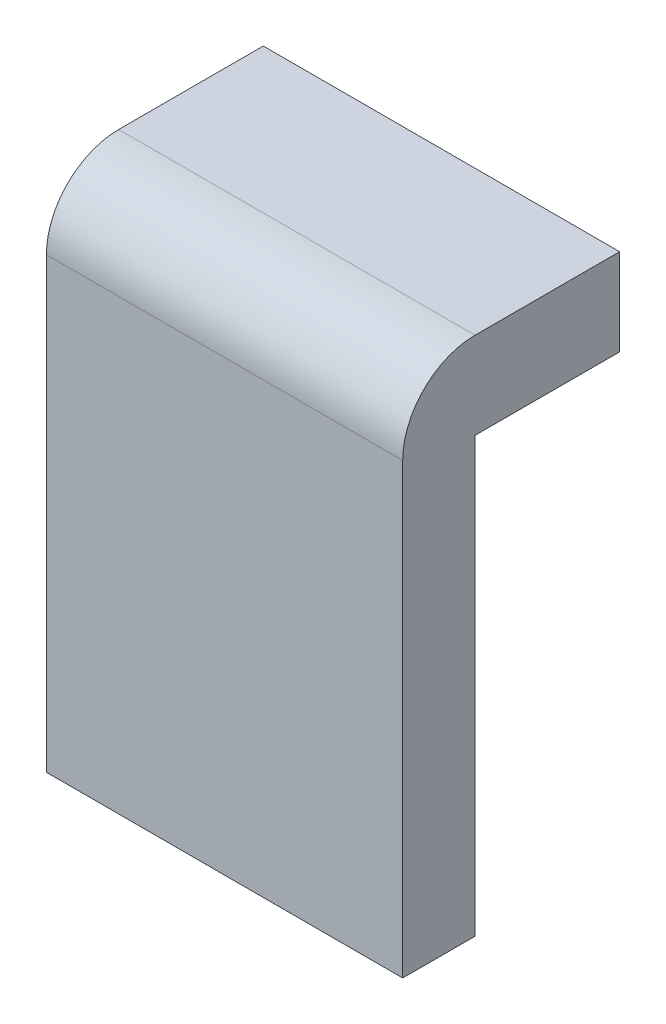
ISO-10303-21;
HEADER;
FILE_DESCRIPTION(('STEP AP214'),'2;1');
FILE_NAME('part.step','',(''),(''),'','','');
FILE_SCHEMA(('AUTOMOTIVE_DESIGN { 1 0 10303 214 1 1 1 1 }'));
ENDSEC;
DATA;
#1=APPLICATION_CONTEXT('core data for automotive mechanical design processes');
#2=APPLICATION_PROTOCOL_DEFINITION('international standard','automotive_design',2000,#1);
#3=PRODUCT_CONTEXT('',#1,'mechanical');
#4=PRODUCT('Part','Part','',(#3));
#5=PRODUCT_RELATED_PRODUCT_CATEGORY('part','',(#4));
#6=PRODUCT_DEFINITION_FORMATION('','',#4);
#7=PRODUCT_DEFINITION_CONTEXT('part definition',#1,'design');
#8=PRODUCT_DEFINITION('design','',#6,#7);
#9=PRODUCT_DEFINITION_SHAPE('','',#8);
#10=(LENGTH_UNIT() NAMED_UNIT(*) SI_UNIT(.MILLI.,.METRE.));
#11=(NAMED_UNIT(*) PLANE_ANGLE_UNIT() SI_UNIT($,.RADIAN.));
#12=(NAMED_UNIT(*) SI_UNIT($,.STERADIAN.) SOLID_ANGLE_UNIT());
#13=UNCERTAINTY_MEASURE_WITH_UNIT(LENGTH_MEASURE(1.E-05),#10,'distance_accuracy_value','');
#14=(GEOMETRIC_REPRESENTATION_CONTEXT(3) GLOBAL_UNCERTAINTY_ASSIGNED_CONTEXT((#13)) GLOBAL_UNIT_ASSIGNED_CONTEXT((#10,
#11,#12)) REPRESENTATION_CONTEXT('',''));
#15=CARTESIAN_POINT('',(0.,0.,0.));
#16=DIRECTION('',(0.,0.,1.));
#17=DIRECTION('',(1.,0.,0.));
#18=AXIS2_PLACEMENT_3D('',#15,#16,#17);
#19=CARTESIAN_POINT('',(-8.34906661620967,8.30000000000001,12.2546737770755));
#20=DIRECTION('',(0.,0.,1.));
#21=DIRECTION('',(0.,-1.,0.));
#22=AXIS2_PLACEMENT_3D('',#19,#20,#21);
#23=PLANE('',#22);
#24=DIRECTION('',(1.,0.,0.));
#25=VECTOR('',#24,1.);
#26=CARTESIAN_POINT('',(-15.8147962412963,6.80000000000003,12.2546737770755));
#27=LINE('',#26,#25);
#28=CARTESIAN_POINT('',(1.63654353343393,6.80000000000003,12.2546737770755));
#29=VERTEX_POINT('',#28);
#30=CARTESIAN_POINT('',(2.86869428987466,6.80000000000003,12.2546737770755));
#31=VERTEX_POINT('',#30);
#32=EDGE_CURVE('E113',#29,#31,#27,.T.);
#33=ORIENTED_EDGE('',*,*,#32,.F.);
#34=DIRECTION('',(0.,1.,0.));
#35=VECTOR('',#34,1.);
#36=CARTESIAN_POINT('',(1.63654353343393,5.35753839337147,12.2546737770755));
#37=LINE('',#36,#35);
#38=CARTESIAN_POINT('',(1.63654353343393,8.30000000000001,12.2546737770755));
#39=VERTEX_POINT('',#38);
#40=EDGE_CURVE('E148',#39,#29,#37,.F.);
#41=ORIENTED_EDGE('',*,*,#40,.F.);
#42=DIRECTION('',(1.,0.,0.));
#43=VECTOR('',#42,1.);
#44=CARTESIAN_POINT('',(-8.34906661620967,8.30000000000001,12.2546737770755));
#45=LINE('',#44,#43);
#46=CARTESIAN_POINT('',(2.86869428987466,8.30000000000001,12.2546737770755));
#47=VERTEX_POINT('',#46);
#48=EDGE_CURVE('E133',#39,#47,#45,.T.);
#49=ORIENTED_EDGE('',*,*,#48,.T.);
#50=DIRECTION('',(0.,1.,0.));
#51=VECTOR('',#50,1.);
#52=CARTESIAN_POINT('',(2.86869428987466,5.35753839337147,12.2546737770755));
#53=LINE('',#52,#51);
#54=EDGE_CURVE('E105',#31,#47,#53,.T.);
#55=ORIENTED_EDGE('',*,*,#54,.F.);
#56=EDGE_LOOP('',(#33,#41,#49,#55));
#57=FACE_BOUND('',#56,.T.);
#58=ADVANCED_FACE('F17',(#57),#23,.F.);
#59=CARTESIAN_POINT('',(-8.34906661620967,8.30000000000001,11.7546737770755));
#60=DIRECTION('',(0.,1.,0.));
#61=DIRECTION('',(0.,0.,1.));
#62=AXIS2_PLACEMENT_3D('',#59,#60,#61);
#63=PLANE('',#62);
#64=ORIENTED_EDGE('',*,*,#48,.F.);
#65=DIRECTION('',(0.,0.,1.));
#66=VECTOR('',#65,1.);
#67=CARTESIAN_POINT('',(1.63654353343393,8.30000000000001,12.5046737770755));
#68=LINE('',#67,#66);
#69=CARTESIAN_POINT('',(1.63654353343393,8.30000000000001,11.7546737770755));
#70=VERTEX_POINT('',#69);
#71=EDGE_CURVE('E153',#70,#39,#68,.T.);
#72=ORIENTED_EDGE('',*,*,#71,.F.);
#73=DIRECTION('',(1.,0.,0.));
#74=VECTOR('',#73,1.);
#75=CARTESIAN_POINT('',(1.63654353343393,8.30000000000001,11.7546737770755));
#76=LINE('',#75,#74);
#77=CARTESIAN_POINT('',(2.86869428987466,8.30000000000001,11.7546737770755));
#78=VERTEX_POINT('',#77);
#79=EDGE_CURVE('E124',#78,#70,#76,.F.);
#80=ORIENTED_EDGE('',*,*,#79,.F.);
#81=DIRECTION('',(0.,0.,-1.));
#82=VECTOR('',#81,1.);
#83=CARTESIAN_POINT('',(2.86869428987466,8.30000000000001,12.5046737770755));
#84=LINE('',#83,#82);
#85=EDGE_CURVE('E129',#47,#78,#84,.T.);
#86=ORIENTED_EDGE('',*,*,#85,.F.);
#87=EDGE_LOOP('',(#64,#72,#80,#86));
#88=FACE_BOUND('',#87,.T.);
#89=ADVANCED_FACE('F175',(#88),#63,.F.);
#90=CARTESIAN_POINT('',(1.63654353343393,5.35753839337146,11.7546737770755));
#91=DIRECTION('',(0.,0.,-1.));
#92=DIRECTION('',(0.,1.,0.));
#93=AXIS2_PLACEMENT_3D('',#90,#91,#92);
#94=PLANE('',#93);
#95=ORIENTED_EDGE('',*,*,#79,.T.);
#96=DIRECTION('',(0.,1.,0.));
#97=VECTOR('',#96,1.);
#98=CARTESIAN_POINT('',(1.63654353343393,5.35753839337147,11.7546737770755));
#99=LINE('',#98,#97);
#100=CARTESIAN_POINT('',(1.63654353343393,8.6,11.7546737770755));
#101=VERTEX_POINT('',#100);
#102=EDGE_CURVE('E119',#101,#70,#99,.F.);
#103=ORIENTED_EDGE('',*,*,#102,.F.);
#104=DIRECTION('',(1.,0.,0.));
#105=VECTOR('',#104,1.);
#106=CARTESIAN_POINT('',(-8.34906661620967,8.6,11.7546737770755));
#107=LINE('',#106,#105);
#108=CARTESIAN_POINT('',(2.86869428987466,8.6,11.7546737770755));
#109=VERTEX_POINT('',#108);
#110=EDGE_CURVE('E122',#101,#109,#107,.T.);
#111=ORIENTED_EDGE('',*,*,#110,.T.);
#112=DIRECTION('',(0.,1.,0.));
#113=VECTOR('',#112,1.);
#114=CARTESIAN_POINT('',(2.86869428987466,5.35753839337147,11.7546737770755));
#115=LINE('',#114,#113);
#116=EDGE_CURVE('E97',#78,#109,#115,.T.);
#117=ORIENTED_EDGE('',*,*,#116,.F.);
#118=EDGE_LOOP('',(#95,#103,#111,#117));
#119=FACE_BOUND('',#118,.T.);
#120=ADVANCED_FACE('F172',(#119),#94,.T.);
#121=CARTESIAN_POINT('',(-8.34906661620967,8.6,11.7546737770755));
#122=DIRECTION('',(0.,-1.,0.));
#123=DIRECTION('',(0.,0.,-1.));
#124=AXIS2_PLACEMENT_3D('',#121,#122,#123);
#125=PLANE('',#124);
#126=ORIENTED_EDGE('',*,*,#110,.F.);
#127=DIRECTION('',(0.,0.,1.));
#128=VECTOR('',#127,1.);
#129=CARTESIAN_POINT('',(1.63654353343393,8.6,12.5046737770755));
#130=LINE('',#129,#128);
#131=CARTESIAN_POINT('',(1.63654353343393,8.6,12.2546737770755));
#132=VERTEX_POINT('',#131);
#133=EDGE_CURVE('E83',#132,#101,#130,.F.);
#134=ORIENTED_EDGE('',*,*,#133,.F.);
#135=DIRECTION('',(1.,0.,0.));
#136=VECTOR('',#135,1.);
#137=CARTESIAN_POINT('',(-8.34906661620967,8.6,12.2546737770755));
#138=LINE('',#137,#136);
#139=CARTESIAN_POINT('',(2.86869428987466,8.6,12.2546737770755));
#140=VERTEX_POINT('',#139);
#141=EDGE_CURVE('E79',#140,#132,#138,.F.);
#142=ORIENTED_EDGE('',*,*,#141,.F.);
#143=DIRECTION('',(0.,0.,-1.));
#144=VECTOR('',#143,1.);
#145=CARTESIAN_POINT('',(2.86869428987466,8.6,12.5046737770755));
#146=LINE('',#145,#144);
#147=EDGE_CURVE('E94',#109,#140,#146,.F.);
#148=ORIENTED_EDGE('',*,*,#147,.F.);
#149=EDGE_LOOP('',(#126,#134,#142,#148));
#150=FACE_BOUND('',#149,.T.);
#151=ADVANCED_FACE('F168',(#150),#125,.F.);
#152=CARTESIAN_POINT('',(-8.34906661620967,8.35,12.2546737770755));
#153=DIRECTION('',(1.,0.,0.));
#154=DIRECTION('',(0.,0.,-1.));
#155=AXIS2_PLACEMENT_3D('',#152,#153,#154);
#156=CYLINDRICAL_SURFACE('',#155,0.249999999999995);
#157=CARTESIAN_POINT('',(1.63654353343393,8.35,12.2546737770755));
#158=DIRECTION('',(1.,0.,0.));
#159=DIRECTION('',(0.,0.,-1.));
#160=AXIS2_PLACEMENT_3D('',#157,#158,#159);
#161=CIRCLE('',#160,0.249999999999995);
#162=CARTESIAN_POINT('',(1.63654353343393,8.35,12.5046737770755));
#163=VERTEX_POINT('',#162);
#164=EDGE_CURVE('E20',#163,#132,#161,.F.);
#165=ORIENTED_EDGE('',*,*,#164,.F.);
#166=DIRECTION('',(1.,0.,0.));
#167=VECTOR('',#166,1.);
#168=CARTESIAN_POINT('',(1.63654353343393,8.35,12.5046737770755));
#169=LINE('',#168,#167);
#170=CARTESIAN_POINT('',(2.86869428987466,8.35,12.5046737770755));
#171=VERTEX_POINT('',#170);
#172=EDGE_CURVE('E77',#171,#163,#169,.F.);
#173=ORIENTED_EDGE('',*,*,#172,.F.);
#174=CARTESIAN_POINT('',(2.86869428987466,8.35,12.2546737770755));
#175=DIRECTION('',(1.,0.,0.));
#176=DIRECTION('',(0.,0.,-1.));
#177=AXIS2_PLACEMENT_3D('',#174,#175,#176);
#178=CIRCLE('',#177,0.249999999999995);
#179=EDGE_CURVE('E106',#140,#171,#178,.T.);
#180=ORIENTED_EDGE('',*,*,#179,.F.);
#181=ORIENTED_EDGE('',*,*,#141,.T.);
#182=EDGE_LOOP('',(#165,#173,#180,#181));
#183=FACE_BOUND('',#182,.T.);
#184=ADVANCED_FACE('F74',(#183),#156,.T.);
#185=CARTESIAN_POINT('',(1.63654353343393,5.35753839337147,12.5046737770755));
#186=DIRECTION('',(-1.,0.,0.));
#187=DIRECTION('',(0.,0.,1.));
#188=AXIS2_PLACEMENT_3D('',#185,#186,#187);
#189=PLANE('',#188);
#190=DIRECTION('',(0.,0.,-1.));
#191=VECTOR('',#190,1.);
#192=CARTESIAN_POINT('',(1.63654353343393,6.80000000000003,12.5046737770755));
#193=LINE('',#192,#191);
#194=CARTESIAN_POINT('',(1.63654353343393,6.80000000000003,12.5046737770755));
#195=VERTEX_POINT('',#194);
#196=EDGE_CURVE('E89',#195,#29,#193,.T.);
#197=ORIENTED_EDGE('',*,*,#196,.F.);
#198=DIRECTION('',(0.,-1.,0.));
#199=VECTOR('',#198,1.);
#200=CARTESIAN_POINT('',(1.63654353343393,5.35753839337147,12.5046737770755));
#201=LINE('',#200,#199);
#202=EDGE_CURVE('E85',#163,#195,#201,.T.);
#203=ORIENTED_EDGE('',*,*,#202,.F.);
#204=ORIENTED_EDGE('',*,*,#164,.T.);
#205=ORIENTED_EDGE('',*,*,#133,.T.);
#206=ORIENTED_EDGE('',*,*,#102,.T.);
#207=ORIENTED_EDGE('',*,*,#71,.T.);
#208=ORIENTED_EDGE('',*,*,#40,.T.);
#209=EDGE_LOOP('',(#197,#203,#204,#205,#206,#207,#208));
#210=FACE_BOUND('',#209,.T.);
#211=ADVANCED_FACE('F86',(#210),#189,.T.);
#212=CARTESIAN_POINT('',(-15.8147962412963,6.80000000000003,12.5046737770755));
#213=DIRECTION('',(0.,-1.,0.));
#214=DIRECTION('',(0.,0.,-1.));
#215=AXIS2_PLACEMENT_3D('',#212,#213,#214);
#216=PLANE('',#215);
#217=DIRECTION('',(1.,0.,0.));
#218=VECTOR('',#217,1.);
#219=CARTESIAN_POINT('',(1.63654353343393,6.80000000000003,12.5046737770755));
#220=LINE('',#219,#218);
#221=CARTESIAN_POINT('',(2.86869428987466,6.80000000000003,12.5046737770755));
#222=VERTEX_POINT('',#221);
#223=EDGE_CURVE('E26',#195,#222,#220,.T.);
#224=ORIENTED_EDGE('',*,*,#223,.F.);
#225=ORIENTED_EDGE('',*,*,#196,.T.);
#226=ORIENTED_EDGE('',*,*,#32,.T.);
#227=DIRECTION('',(0.,0.,-1.));
#228=VECTOR('',#227,1.);
#229=CARTESIAN_POINT('',(2.86869428987466,6.80000000000003,12.5046737770755));
#230=LINE('',#229,#228);
#231=EDGE_CURVE('E35',#222,#31,#230,.T.);
#232=ORIENTED_EDGE('',*,*,#231,.F.);
#233=EDGE_LOOP('',(#224,#225,#226,#232));
#234=FACE_BOUND('',#233,.T.);
#235=ADVANCED_FACE('F179',(#234),#216,.T.);
#236=CARTESIAN_POINT('',(2.86869428987466,5.35753839337147,12.5046737770755));
#237=DIRECTION('',(1.,0.,0.));
#238=DIRECTION('',(0.,0.,-1.));
#239=AXIS2_PLACEMENT_3D('',#236,#237,#238);
#240=PLANE('',#239);
#241=ORIENTED_EDGE('',*,*,#116,.T.);
#242=ORIENTED_EDGE('',*,*,#147,.T.);
#243=ORIENTED_EDGE('',*,*,#179,.T.);
#244=DIRECTION('',(0.,-1.,0.));
#245=VECTOR('',#244,1.);
#246=CARTESIAN_POINT('',(2.86869428987466,5.35753839337147,12.5046737770755));
#247=LINE('',#246,#245);
#248=EDGE_CURVE('E11',#222,#171,#247,.F.);
#249=ORIENTED_EDGE('',*,*,#248,.F.);
#250=ORIENTED_EDGE('',*,*,#231,.T.);
#251=ORIENTED_EDGE('',*,*,#54,.T.);
#252=ORIENTED_EDGE('',*,*,#85,.T.);
#253=EDGE_LOOP('',(#241,#242,#243,#249,#250,#251,#252));
#254=FACE_BOUND('',#253,.T.);
#255=ADVANCED_FACE('F164',(#254),#240,.T.);
#256=CARTESIAN_POINT('',(1.63654353343393,5.35753839337147,12.5046737770755));
#257=DIRECTION('',(0.,0.,1.));
#258=DIRECTION('',(0.,-1.,0.));
#259=AXIS2_PLACEMENT_3D('',#256,#257,#258);
#260=PLANE('',#259);
#261=ORIENTED_EDGE('',*,*,#223,.T.);
#262=ORIENTED_EDGE('',*,*,#248,.T.);
#263=ORIENTED_EDGE('',*,*,#172,.T.);
#264=ORIENTED_EDGE('',*,*,#202,.T.);
#265=EDGE_LOOP('',(#261,#262,#263,#264));
#266=FACE_BOUND('',#265,.T.);
#267=ADVANCED_FACE('F93',(#266),#260,.T.);
#268=CLOSED_SHELL('',(#58,#89,#120,#151,#184,#211,#235,#255,#267));
#269=MANIFOLD_SOLID_BREP('B1',#268);
#270=ADVANCED_BREP_SHAPE_REPRESENTATION('',(#18,#269),#14);
#271=SHAPE_DEFINITION_REPRESENTATION(#9,#270);
ENDSEC;
END-ISO-10303-21;
